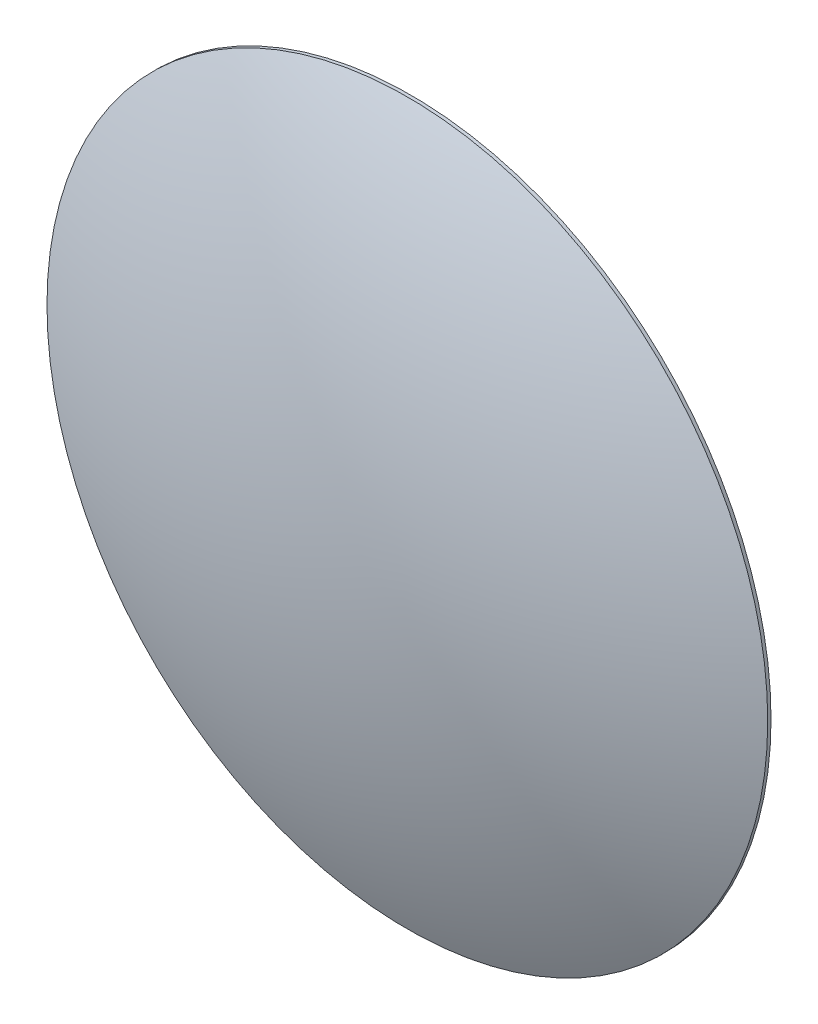
ISO-10303-21;
HEADER;
FILE_DESCRIPTION(('STEP AP214'),'2;1');
FILE_NAME('part.step','',(''),(''),'','','');
FILE_SCHEMA(('AUTOMOTIVE_DESIGN { 1 0 10303 214 1 1 1 1 }'));
ENDSEC;
DATA;
#1=APPLICATION_CONTEXT('core data for automotive mechanical design processes');
#2=APPLICATION_PROTOCOL_DEFINITION('international standard','automotive_design',2000,#1);
#3=PRODUCT_CONTEXT('',#1,'mechanical');
#4=PRODUCT('Part','Part','',(#3));
#5=PRODUCT_RELATED_PRODUCT_CATEGORY('part','',(#4));
#6=PRODUCT_DEFINITION_FORMATION('','',#4);
#7=PRODUCT_DEFINITION_CONTEXT('part definition',#1,'design');
#8=PRODUCT_DEFINITION('design','',#6,#7);
#9=PRODUCT_DEFINITION_SHAPE('','',#8);
#10=(LENGTH_UNIT() NAMED_UNIT(*) SI_UNIT(.MILLI.,.METRE.));
#11=(NAMED_UNIT(*) PLANE_ANGLE_UNIT() SI_UNIT($,.RADIAN.));
#12=(NAMED_UNIT(*) SI_UNIT($,.STERADIAN.) SOLID_ANGLE_UNIT());
#13=UNCERTAINTY_MEASURE_WITH_UNIT(LENGTH_MEASURE(1.E-05),#10,'distance_accuracy_value','');
#14=(GEOMETRIC_REPRESENTATION_CONTEXT(3) GLOBAL_UNCERTAINTY_ASSIGNED_CONTEXT((#13)) GLOBAL_UNIT_ASSIGNED_CONTEXT((#10,
#11,#12)) REPRESENTATION_CONTEXT('',''));
#15=CARTESIAN_POINT('',(0.,0.,0.));
#16=DIRECTION('',(0.,0.,1.));
#17=DIRECTION('',(1.,0.,0.));
#18=AXIS2_PLACEMENT_3D('',#15,#16,#17);
#19=CARTESIAN_POINT('',(0.,0.,0.1));
#20=DIRECTION('',(0.,0.,-1.));
#21=DIRECTION('',(-1.,0.,0.));
#22=AXIS2_PLACEMENT_3D('',#19,#20,#21);
#23=CYLINDRICAL_SURFACE('',#22,11.);
#24=CARTESIAN_POINT('',(0.,0.,0.1));
#25=DIRECTION('',(0.,0.,1.));
#26=DIRECTION('',(1.,0.,0.));
#27=AXIS2_PLACEMENT_3D('',#24,#25,#26);
#28=CIRCLE('',#27,11.);
#29=CARTESIAN_POINT('',(11.,0.,0.1));
#30=VERTEX_POINT('',#29);
#31=EDGE_CURVE('E10',#30,#30,#28,.T.);
#32=ORIENTED_EDGE('',*,*,#31,.F.);
#33=EDGE_LOOP('',(#32));
#34=FACE_BOUND('',#33,.T.);
#35=CARTESIAN_POINT('',(0.,0.,0.));
#36=DIRECTION('',(0.,0.,1.));
#37=DIRECTION('',(1.,0.,0.));
#38=AXIS2_PLACEMENT_3D('',#35,#36,#37);
#39=CIRCLE('',#38,11.);
#40=CARTESIAN_POINT('',(11.,0.,0.));
#41=VERTEX_POINT('',#40);
#42=EDGE_CURVE('E46',#41,#41,#39,.T.);
#43=ORIENTED_EDGE('',*,*,#42,.T.);
#44=EDGE_LOOP('',(#43));
#45=FACE_BOUND('',#44,.T.);
#46=ADVANCED_FACE('F38',(#34,#45),#23,.T.);
#47=CARTESIAN_POINT('',(0.,0.,-23.9083333333333));
#48=DIRECTION('',(0.,0.,1.));
#49=DIRECTION('',(1.,0.,0.));
#50=AXIS2_PLACEMENT_3D('',#47,#48,#49);
#51=SPHERICAL_SURFACE('',#50,26.4083333333333);
#52=ORIENTED_EDGE('',*,*,#31,.T.);
#53=EDGE_LOOP('',(#52));
#54=FACE_BOUND('',#53,.T.);
#55=ADVANCED_FACE('F40',(#54),#51,.T.);
#56=CARTESIAN_POINT('',(0.,0.,0.));
#57=DIRECTION('',(0.,0.,1.));
#58=DIRECTION('',(1.,0.,0.));
#59=AXIS2_PLACEMENT_3D('',#56,#57,#58);
#60=PLANE('',#59);
#61=ORIENTED_EDGE('',*,*,#42,.F.);
#62=EDGE_LOOP('',(#61));
#63=FACE_BOUND('',#62,.T.);
#64=ADVANCED_FACE('F56',(#63),#60,.F.);
#65=CLOSED_SHELL('',(#46,#55,#64));
#66=MANIFOLD_SOLID_BREP('B2',#65);
#67=ADVANCED_BREP_SHAPE_REPRESENTATION('',(#18,#66),#14);
#68=SHAPE_DEFINITION_REPRESENTATION(#9,#67);
ENDSEC;
END-ISO-10303-21;
